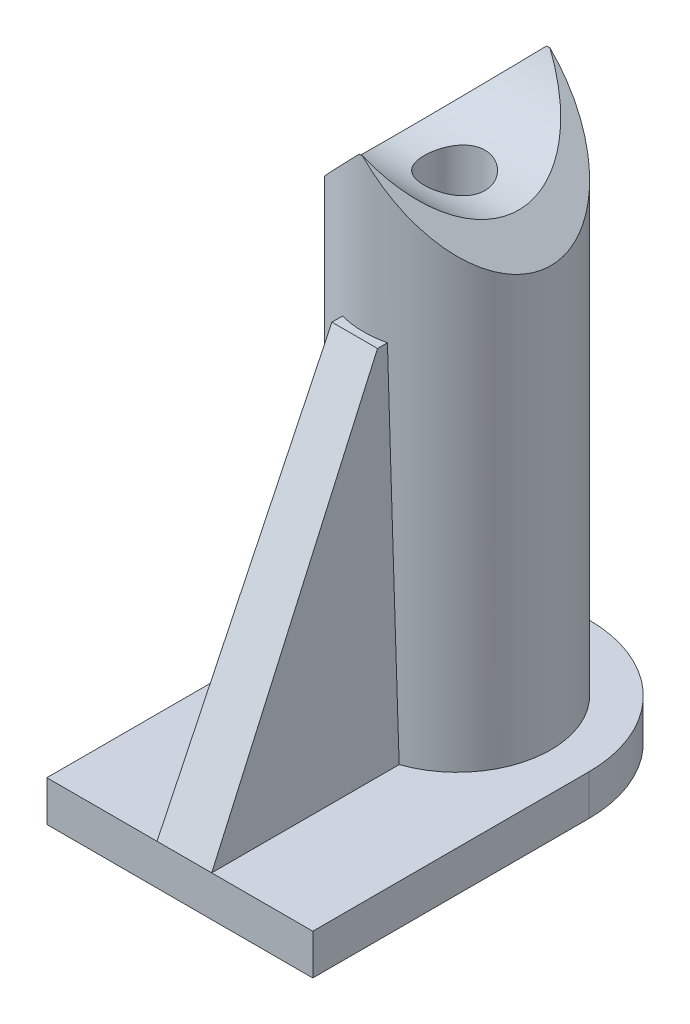
ISO-10303-21;
HEADER;
FILE_DESCRIPTION(('STEP AP214'),'2;1');
FILE_NAME('part.step','',(''),(''),'','','');
FILE_SCHEMA(('AUTOMOTIVE_DESIGN { 1 0 10303 214 1 1 1 1 }'));
ENDSEC;
DATA;
#1=APPLICATION_CONTEXT('core data for automotive mechanical design processes');
#2=APPLICATION_PROTOCOL_DEFINITION('international standard','automotive_design',2000,#1);
#3=PRODUCT_CONTEXT('',#1,'mechanical');
#4=PRODUCT('Part','Part','',(#3));
#5=PRODUCT_RELATED_PRODUCT_CATEGORY('part','',(#4));
#6=PRODUCT_DEFINITION_FORMATION('','',#4);
#7=PRODUCT_DEFINITION_CONTEXT('part definition',#1,'design');
#8=PRODUCT_DEFINITION('design','',#6,#7);
#9=PRODUCT_DEFINITION_SHAPE('','',#8);
#10=(LENGTH_UNIT() NAMED_UNIT(*) SI_UNIT(.MILLI.,.METRE.));
#11=(NAMED_UNIT(*) PLANE_ANGLE_UNIT() SI_UNIT($,.RADIAN.));
#12=(NAMED_UNIT(*) SI_UNIT($,.STERADIAN.) SOLID_ANGLE_UNIT());
#13=UNCERTAINTY_MEASURE_WITH_UNIT(LENGTH_MEASURE(1.E-05),#10,'distance_accuracy_value','');
#14=(GEOMETRIC_REPRESENTATION_CONTEXT(3) GLOBAL_UNCERTAINTY_ASSIGNED_CONTEXT((#13)) GLOBAL_UNIT_ASSIGNED_CONTEXT((#10,
#11,#12)) REPRESENTATION_CONTEXT('',''));
#15=CARTESIAN_POINT('',(0.,0.,0.));
#16=DIRECTION('',(0.,0.,1.));
#17=DIRECTION('',(1.,0.,0.));
#18=AXIS2_PLACEMENT_3D('',#15,#16,#17);
#19=CARTESIAN_POINT('',(-5.2,21.9,5.2));
#20=DIRECTION('',(0.,-1.,0.));
#21=DIRECTION('',(0.,0.,-1.));
#22=AXIS2_PLACEMENT_3D('',#19,#20,#21);
#23=CYLINDRICAL_SURFACE('',#22,3.7);
#24=CARTESIAN_POINT('',(-5.2,15.9,5.2));
#25=DIRECTION('',(0.,-1.,0.));
#26=DIRECTION('',(0.,0.,1.));
#27=AXIS2_PLACEMENT_3D('',#24,#25,#26);
#28=CIRCLE('',#27,3.7);
#29=CARTESIAN_POINT('',(-6.15,15.9,8.77596140918774));
#30=VERTEX_POINT('',#29);
#31=CARTESIAN_POINT('',(-4.34999999997192,15.9,8.80104151599954));
#32=VERTEX_POINT('',#31);
#33=EDGE_CURVE('E142',#30,#32,#28,.F.);
#34=ORIENTED_EDGE('',*,*,#33,.T.);
#35=CARTESIAN_POINT('',(-5.2,49.7751500020347,5.2));
#36=DIRECTION('',(-0.999685340837746,-0.0250842443402034,0.));
#37=DIRECTION('',(0.0250842443402034,-0.999685340837746,0.));
#38=AXIS2_PLACEMENT_3D('',#35,#36,#37);
#39=ELLIPSE('',#38,147.502948457167,3.7);
#40=CARTESIAN_POINT('',(-3.99118240068989,1.6,8.69696439953256));
#41=VERTEX_POINT('',#40);
#42=EDGE_CURVE('E176',#32,#41,#39,.F.);
#43=ORIENTED_EDGE('',*,*,#42,.T.);
#44=CARTESIAN_POINT('',(-5.2,1.6,5.2));
#45=DIRECTION('',(0.,-1.,0.));
#46=DIRECTION('',(0.,0.,1.));
#47=AXIS2_PLACEMENT_3D('',#44,#45,#46);
#48=CIRCLE('',#47,3.7);
#49=CARTESIAN_POINT('',(-6.15,1.6,8.77596140918774));
#50=VERTEX_POINT('',#49);
#51=EDGE_CURVE('E166',#50,#41,#48,.T.);
#52=ORIENTED_EDGE('',*,*,#51,.F.);
#53=DIRECTION('',(0.,-1.,0.));
#54=VECTOR('',#53,1.);
#55=CARTESIAN_POINT('',(-6.15,21.9,8.77596140918774));
#56=LINE('',#55,#54);
#57=EDGE_CURVE('E172',#50,#30,#56,.F.);
#58=ORIENTED_EDGE('',*,*,#57,.T.);
#59=EDGE_LOOP('',(#34,#43,#52,#58));
#60=FACE_BOUND('',#59,.T.);
#61=CARTESIAN_POINT('',(-5.2,21.8589822391826,5.2));
#62=DIRECTION('',(0.707106781186554,0.707106781186541,0.));
#63=DIRECTION('',(0.707106781186541,-0.707106781186554,0.));
#64=AXIS2_PLACEMENT_3D('',#61,#62,#63);
#65=ELLIPSE('',#64,5.2325901807805,3.7);
#66=CARTESIAN_POINT('',(-5.24048307471345,21.8994653138961,8.89977852319053));
#67=VERTEX_POINT('',#66);
#68=CARTESIAN_POINT('',(-5.24048307471566,21.8994653138983,1.50022147680951));
#69=VERTEX_POINT('',#68);
#70=EDGE_CURVE('E303',#67,#69,#65,.T.);
#71=ORIENTED_EDGE('',*,*,#70,.F.);
#72=CARTESIAN_POINT('',(-5.2,21.9,1.5));
#73=CARTESIAN_POINT('',(-5.30220118854143,21.8999861552881,1.50000329053625));
#74=CARTESIAN_POINT('',(-5.40441808191666,21.8894947726479,1.50429955744503));
#75=CARTESIAN_POINT('',(-5.60491412544944,21.8505158880821,1.52082991556372));
#76=CARTESIAN_POINT('',(-5.70317145254614,21.8219401894823,1.53310291703705));
#77=CARTESIAN_POINT('',(-5.87121813598477,21.7608106945932,1.56064452022894));
#78=CARTESIAN_POINT('',(-5.9422303586275,21.7308096358502,1.57451135835405));
#79=CARTESIAN_POINT('',(-6.08114170375435,21.6657767440427,1.60574743157836));
#80=CARTESIAN_POINT('',(-6.14903848089882,21.6307412003586,1.62311925384308));
#81=CARTESIAN_POINT('',(-6.3488882967008,21.5203913532359,1.68014901349179));
#82=CARTESIAN_POINT('',(-6.4766289158008,21.4399884665495,1.72465651225778));
#83=CARTESIAN_POINT('',(-6.71490698259938,21.2792030770967,1.82206581039771));
#84=CARTESIAN_POINT('',(-6.82602362636766,21.1991854825654,1.8741982756588));
#85=CARTESIAN_POINT('',(-7.04178237073929,21.0375117296007,1.988652379036));
#86=CARTESIAN_POINT('',(-7.14641969850108,20.9558544205898,2.05098140797828));
#87=CARTESIAN_POINT('',(-7.34933835839138,20.7933716974848,2.18584035487792));
#88=CARTESIAN_POINT('',(-7.44762715750579,20.7125454036964,2.25835795817353));
#89=CARTESIAN_POINT('',(-7.63769373918767,20.5534781770391,2.41383547186427));
#90=CARTESIAN_POINT('',(-7.72947509825423,20.4752358368578,2.4967895756838));
#91=CARTESIAN_POINT('',(-7.94897003387618,20.2858132103856,2.71652359058631));
#92=CARTESIAN_POINT('',(-8.07243404960116,20.17713330954,2.85985218041348));
#93=CARTESIAN_POINT('',(-8.29972739769978,19.9748992604763,3.17056111703932));
#94=CARTESIAN_POINT('',(-8.40359109775338,19.8813186793218,3.33789844179852));
#95=CARTESIAN_POINT('',(-8.56769351525543,19.7325174236787,3.65917248392195));
#96=CARTESIAN_POINT('',(-8.63250893189407,19.6733658437209,3.80889636296508));
#97=CARTESIAN_POINT('',(-8.71531935387495,19.5975488037141,4.04267961874061));
#98=CARTESIAN_POINT('',(-8.74052581938986,19.5744234473959,4.12216415322763));
#99=CARTESIAN_POINT('',(-8.78574586885089,19.5328819696268,4.28378172649424));
#100=CARTESIAN_POINT('',(-8.80576173225587,19.5144637810694,4.36591358482189));
#101=CARTESIAN_POINT('',(-8.84037438059293,19.4825850155868,4.53291625862229));
#102=CARTESIAN_POINT('',(-8.85493005397909,19.4691620551388,4.6178028219736));
#103=CARTESIAN_POINT('',(-8.8781188954863,19.4477664657864,4.78902392698739));
#104=CARTESIAN_POINT('',(-8.88675481697309,19.4397913030353,4.87535777632688));
#105=CARTESIAN_POINT('',(-8.89792707773942,19.4294723859938,5.04875009447969));
#106=CARTESIAN_POINT('',(-8.90046426153741,19.4271278520061,5.13580846129038));
#107=CARTESIAN_POINT('',(-8.89939502498305,19.4281155077124,5.3098263625634));
#108=CARTESIAN_POINT('',(-8.89578913137733,19.4314472106896,5.39678590485979));
#109=CARTESIAN_POINT('',(-8.87729749793132,19.4485254769984,5.63732403115231));
#110=CARTESIAN_POINT('',(-8.85581456543738,19.4683619230852,5.79004772530705));
#111=CARTESIAN_POINT('',(-8.79494752668963,19.5244260631929,6.0886169113682));
#112=CARTESIAN_POINT('',(-8.75556053690702,19.5606563975187,6.23446129115233));
#113=CARTESIAN_POINT('',(-8.65915777708952,19.6490013357018,6.52218096357648));
#114=CARTESIAN_POINT('',(-8.60149315320657,19.7016993707302,6.66365684117055));
#115=CARTESIAN_POINT('',(-8.47185455136396,19.8195068617113,6.93422221612513));
#116=CARTESIAN_POINT('',(-8.39987406841147,19.8846219593055,7.06330604297315));
#117=CARTESIAN_POINT('',(-8.20303543467088,20.0613385184196,7.3727465047799));
#118=CARTESIAN_POINT('',(-8.07025366533381,20.1794003471286,7.5444517801073));
#119=CARTESIAN_POINT('',(-7.8552833242326,20.3668029792136,7.77891327632925));
#120=CARTESIAN_POINT('',(-7.78083598440948,20.4311217894035,7.85333779192149));
#121=CARTESIAN_POINT('',(-7.62710408869393,20.5622521462416,7.99464681061368));
#122=CARTESIAN_POINT('',(-7.54782037954333,20.6290632557519,8.06153262776773));
#123=CARTESIAN_POINT('',(-7.38270755339974,20.7658470685964,8.18947787001646));
#124=CARTESIAN_POINT('',(-7.29676403040008,20.8358570312878,8.25034867814242));
#125=CARTESIAN_POINT('',(-7.12021819440276,20.9762227226005,8.36446055571283));
#126=CARTESIAN_POINT('',(-7.02961589020273,21.0465784505687,8.41770163956452));
#127=CARTESIAN_POINT('',(-6.84371911662066,21.1859742738523,8.51651169910498));
#128=CARTESIAN_POINT('',(-6.7484354647991,21.2550169341498,8.56209737795193));
#129=CARTESIAN_POINT('',(-6.55240484099297,21.3897878350268,8.64562805067155));
#130=CARTESIAN_POINT('',(-6.4516626553041,21.4555188848057,8.68357960515771));
#131=CARTESIAN_POINT('',(-6.25803884625461,21.5715853266806,8.74674847699734));
#132=CARTESIAN_POINT('',(-6.16602551800486,21.6227886319086,8.77300413514137));
#133=CARTESIAN_POINT('',(-5.97609902991764,21.7166474417492,8.81900546456139));
#134=CARTESIAN_POINT('',(-5.87819132229475,21.759310692452,8.83875704582132));
#135=CARTESIAN_POINT('',(-5.69398275994262,21.824211571132,8.86783907755175));
#136=CARTESIAN_POINT('',(-5.60871212833711,21.8487318921207,8.8783978229424));
#137=CARTESIAN_POINT('',(-5.43499064708258,21.8843944220393,8.89355218953716));
#138=CARTESIAN_POINT('',(-5.34654977895478,21.8955753716575,8.89816508205651));
#139=CARTESIAN_POINT('',(-5.1684178303178,21.9022688925758,8.90094179408382));
#140=CARTESIAN_POINT('',(-5.0787224795727,21.8976906186907,8.89906822153492));
#141=CARTESIAN_POINT('',(-4.90163506783468,21.8737114802237,8.88902357604518));
#142=CARTESIAN_POINT('',(-4.81424891151067,21.8542758263313,8.88083772218301));
#143=CARTESIAN_POINT('',(-4.60424539800062,21.7926146959105,8.85389120673591));
#144=CARTESIAN_POINT('',(-4.48398705089301,21.7440104710673,8.83199328062005));
#145=CARTESIAN_POINT('',(-4.25200081237684,21.633367465955,8.77848967156498));
#146=CARTESIAN_POINT('',(-4.1403135975003,21.5712694115346,8.74684089138749));
#147=CARTESIAN_POINT('',(-3.92158780233785,21.4386589659623,8.67407787442097));
#148=CARTESIAN_POINT('',(-3.81471718222212,21.3679847873628,8.63276107585714));
#149=CARTESIAN_POINT('',(-3.60705469743022,21.223251063502,8.54146635361594));
#150=CARTESIAN_POINT('',(-3.50626843930291,21.1491885031527,8.49148060116859));
#151=CARTESIAN_POINT('',(-3.31016484905568,21.0001428963845,8.38293440136031));
#152=CARTESIAN_POINT('',(-3.21484707794647,20.9251599244411,8.32437464363216));
#153=CARTESIAN_POINT('',(-3.02945771872571,20.7759509852149,8.19854928097493));
#154=CARTESIAN_POINT('',(-2.93938733571104,20.7017251950273,8.13128168757391));
#155=CARTESIAN_POINT('',(-2.77391470184935,20.5631483153687,7.99541075793236));
#156=CARTESIAN_POINT('',(-2.69796703209827,20.498581013182,7.92769548082345));
#157=CARTESIAN_POINT('',(-2.55080753368635,20.3721089310101,7.78501348280166));
#158=CARTESIAN_POINT('',(-2.47959710877104,20.3102049421235,7.71004462851065));
#159=CARTESIAN_POINT('',(-2.27414484646608,20.1301473592317,7.47435968492877));
#160=CARTESIAN_POINT('',(-2.14759265128003,20.0172317576592,7.30247020197285));
#161=CARTESIAN_POINT('',(-1.95006835475449,19.8394328351368,6.97612761517814));
#162=CARTESIAN_POINT('',(-1.87310739690448,19.7695950018666,6.8280285474842));
#163=CARTESIAN_POINT('',(-1.77191614604515,19.6773654333157,6.59479098951195));
#164=CARTESIAN_POINT('',(-1.74055307160102,19.6487030021413,6.51516994994541));
#165=CARTESIAN_POINT('',(-1.68304572006378,19.5960517222737,6.35258736956468));
#166=CARTESIAN_POINT('',(-1.65689908409703,19.5720607612598,6.26962735912183));
#167=CARTESIAN_POINT('',(-1.61005302250855,19.5290191966639,6.10004987450945));
#168=CARTESIAN_POINT('',(-1.58940608299807,19.5100162190577,6.01340571641963));
#169=CARTESIAN_POINT('',(-1.55430073790507,19.477676756696,5.83787279007397));
#170=CARTESIAN_POINT('',(-1.53983915151879,19.4643373594831,5.7489852004641));
#171=CARTESIAN_POINT('',(-1.51741320435203,19.4436416114366,5.56974057516832));
#172=CARTESIAN_POINT('',(-1.50944598374084,19.4362826270987,5.47938420416652));
#173=CARTESIAN_POINT('',(-1.50018550159053,19.4277284614055,5.2980455479931));
#174=CARTESIAN_POINT('',(-1.49889136310207,19.4265324701348,5.20706334663922));
#175=CARTESIAN_POINT('',(-1.50273133795836,19.4300800848953,5.03750184025578));
#176=CARTESIAN_POINT('',(-1.50703154373526,19.4340531783333,4.95888591500431));
#177=CARTESIAN_POINT('',(-1.52058113616982,19.4465646949622,4.80243951206051));
#178=CARTESIAN_POINT('',(-1.52983212305178,19.4551045942658,4.72460929662258));
#179=CARTESIAN_POINT('',(-1.56479954429822,19.4873583402911,4.4931912479431));
#180=CARTESIAN_POINT('',(-1.59773431492487,19.5177098625377,4.34152290040802));
#181=CARTESIAN_POINT('',(-1.68085260857059,19.5940587072025,4.04714024146694));
#182=CARTESIAN_POINT('',(-1.73105379554968,19.6400720515401,3.90443527731985));
#183=CARTESIAN_POINT('',(-1.84617469648876,19.7450843648457,3.63029179150034));
#184=CARTESIAN_POINT('',(-1.91109842686952,19.8040868772282,3.49885635775012));
#185=CARTESIAN_POINT('',(-2.08763353221639,19.9634822492083,3.18784480500316));
#186=CARTESIAN_POINT('',(-2.20666130525578,20.0701139465709,3.01561878353005));
#187=CARTESIAN_POINT('',(-2.40073927814134,20.2412345821472,2.77829174664166));
#188=CARTESIAN_POINT('',(-2.46817827853062,20.3002718261999,2.7025488874264));
#189=CARTESIAN_POINT('',(-2.60773559369747,20.4212238697834,2.55798548731715));
#190=CARTESIAN_POINT('',(-2.67985264960703,20.483137893909,2.4891630967287));
#191=CARTESIAN_POINT('',(-2.84711905796357,20.6248893632137,2.34179502736361));
#192=CARTESIAN_POINT('',(-2.94348391482636,20.7053028363687,2.26518625776051));
#193=CARTESIAN_POINT('',(-3.14256875860694,20.8676092341126,2.12233850521157));
#194=CARTESIAN_POINT('',(-3.24529297337529,20.9495031167383,2.05610652656885));
#195=CARTESIAN_POINT('',(-3.45696348842228,21.1124812684457,1.93400324514867));
#196=CARTESIAN_POINT('',(-3.56589791858349,21.1935667556203,1.87811299002446));
#197=CARTESIAN_POINT('',(-3.79085081751589,21.3521007693557,1.77662039437046));
#198=CARTESIAN_POINT('',(-3.90686071313561,21.4295535038604,1.73100590574176));
#199=CARTESIAN_POINT('',(-4.1246629455183,21.5619174797247,1.65822286333507));
#200=CARTESIAN_POINT('',(-4.2249209188819,21.6183044183054,1.62919461275267));
#201=CARTESIAN_POINT('',(-4.43242739644737,21.7208711168502,1.57892349221635));
#202=CARTESIAN_POINT('',(-4.53966258091512,21.7670696270273,1.55766627264631));
#203=CARTESIAN_POINT('',(-4.73869205280249,21.8341938119413,1.52779556067708));
#204=CARTESIAN_POINT('',(-4.82908163688891,21.8583726846856,1.51747486604692));
#205=CARTESIAN_POINT('',(-5.01298508059262,21.8912532891681,1.50358816134696));
#206=CARTESIAN_POINT('',(-5.10648596606411,21.9000126679041,1.49999698916105));
#207=CARTESIAN_POINT('',(-5.2,21.9,1.5));
#208=B_SPLINE_CURVE_WITH_KNOTS('',3,(#72,#73,#74,#75,#76,#77,#78,#79,#80,#81,#82,#83,#84,#85,
#86,#87,#88,#89,#90,#91,#92,#93,#94,#95,#96,#97,#98,#99,#100,#101,#102,#103,#104,#105,#106,#107,
#108,#109,#110,#111,#112,#113,#114,#115,#116,#117,#118,#119,#120,#121,#122,#123,#124,#125,#126,
#127,#128,#129,#130,#131,#132,#133,#134,#135,#136,#137,#138,#139,#140,#141,#142,#143,#144,#145,
#146,#147,#148,#149,#150,#151,#152,#153,#154,#155,#156,#157,#158,#159,#160,#161,#162,#163,#164,
#165,#166,#167,#168,#169,#170,#171,#172,#173,#174,#175,#176,#177,#178,#179,#180,#181,#182,#183,
#184,#185,#186,#187,#188,#189,#190,#191,#192,#193,#194,#195,#196,#197,#198,#199,#200,#201,#202,
#203,#204,#205,#206,#207),.UNSPECIFIED.,.T.,.F.,(4,2,2,2,2,2,2,2,2,2,2,2,2,2,2,2,2,2,2,2,2,2,2,
2,2,2,2,2,2,2,2,2,2,2,2,2,2,2,2,2,2,2,2,2,2,2,2,2,2,2,2,2,2,2,2,2,2,2,2,2,2,2,2,2,2,2,2,4),(0.,
0.306146909046892,0.613798516304356,0.848451404357704,1.08327813673251,1.55414308601822,
1.9932268897018,2.43263037842291,2.87150726894867,3.31014105167947,3.96223233682261,
4.61316938333827,5.13152126219224,5.39084450968198,5.65005368147635,5.91117711399101,
6.17217901150641,6.43314476488294,6.69408814251727,7.15823252357075,7.62245168365977,
8.1054554126339,8.58867911749745,9.32554281108332,9.69539213393251,10.065176889124,
10.4442527338627,10.8233278627804,11.2015648363416,11.579475358725,11.9045857812986,
12.2293999691114,12.496479259933,12.762780986333,13.0306203929502,13.299088887505,
13.6914940503146,14.0856590855335,14.4889686421615,14.8926443349392,15.2962875766972,
15.7000231552703,16.0612053843314,16.4224941669151,17.1428322337963,17.6834011663558,
17.953857332953,18.2241909206684,18.4970188144603,18.7697062379472,19.0422735170162,
19.3148049754884,19.5510072288074,19.7872858751379,20.2593895560146,20.7319776540032,
21.2046948330189,21.9053717739188,22.257180507078,22.608894957883,23.0494760386993,
23.4903532409564,23.9304143071714,24.3699523669107,24.7252798850365,25.0799479178643,
25.3611256348037,25.6412498960825),.UNSPECIFIED.);
#209=CARTESIAN_POINT('',(-5.36614753596505,21.8910185891588,8.89626771166439));
#210=VERTEX_POINT('',#209);
#211=EDGE_CURVE('E239',#210,#67,#208,.T.);
#212=ORIENTED_EDGE('',*,*,#211,.F.);
#213=CARTESIAN_POINT('',(-5.2,22.0617277897651,5.2));
#214=DIRECTION('',(-0.716616613550526,0.697467296138949,0.));
#215=DIRECTION('',(-0.697467296138949,-0.716616613550526,0.));
#216=AXIS2_PLACEMENT_3D('',#213,#214,#215);
#217=ELLIPSE('',#216,5.30490823079809,3.7);
#218=CARTESIAN_POINT('',(-7.79060151478678,19.4,7.84173878186024));
#219=VERTEX_POINT('',#218);
#220=EDGE_CURVE('E300',#219,#210,#217,.T.);
#221=ORIENTED_EDGE('',*,*,#220,.F.);
#222=DIRECTION('',(0.,-1.,0.));
#223=VECTOR('',#222,1.);
#224=CARTESIAN_POINT('',(-7.79060151478678,22.2116350067327,7.84173878186024));
#225=LINE('',#224,#223);
#226=CARTESIAN_POINT('',(-7.79060151478678,16.4,7.84173878186024));
#227=VERTEX_POINT('',#226);
#228=EDGE_CURVE('E310',#219,#227,#225,.T.);
#229=ORIENTED_EDGE('',*,*,#228,.T.);
#230=CARTESIAN_POINT('',(-5.2,16.4,5.2));
#231=DIRECTION('',(0.,-1.,0.));
#232=DIRECTION('',(0.,0.,1.));
#233=AXIS2_PLACEMENT_3D('',#230,#231,#232);
#234=CIRCLE('',#233,3.7);
#235=CARTESIAN_POINT('',(-7.79060151478678,16.4,2.55826121813976));
#236=VERTEX_POINT('',#235);
#237=EDGE_CURVE('E306',#227,#236,#234,.T.);
#238=ORIENTED_EDGE('',*,*,#237,.T.);
#239=DIRECTION('',(0.,-1.,0.));
#240=VECTOR('',#239,1.);
#241=CARTESIAN_POINT('',(-7.79060151478678,22.2116350067327,2.55826121813976));
#242=LINE('',#241,#240);
#243=CARTESIAN_POINT('',(-7.79060151478678,19.4,2.55826121813976));
#244=VERTEX_POINT('',#243);
#245=EDGE_CURVE('E240',#244,#236,#242,.T.);
#246=ORIENTED_EDGE('',*,*,#245,.F.);
#247=CARTESIAN_POINT('',(-5.36614753596487,21.8910185891588,1.5037322883356));
#248=VERTEX_POINT('',#247);
#249=EDGE_CURVE('E297',#248,#244,#217,.T.);
#250=ORIENTED_EDGE('',*,*,#249,.F.);
#251=EDGE_CURVE('E233',#69,#248,#208,.T.);
#252=ORIENTED_EDGE('',*,*,#251,.F.);
#253=EDGE_LOOP('',(#71,#212,#221,#229,#238,#246,#250,#252));
#254=FACE_BOUND('',#253,.T.);
#255=ADVANCED_FACE('F33',(#60,#254),#23,.T.);
#256=CARTESIAN_POINT('',(9.8,23.4322947838148,5.2));
#257=DIRECTION('',(-1.,0.,0.));
#258=DIRECTION('',(0.,0.,-1.));
#259=AXIS2_PLACEMENT_3D('',#256,#257,#258);
#260=CYLINDRICAL_SURFACE('',#259,4.00473810685618);
#261=CARTESIAN_POINT('',(-5.3,19.6115713831345,4.));
#262=CARTESIAN_POINT('',(-5.23424040619088,19.6115706960729,4.00000082883482));
#263=CARTESIAN_POINT('',(-5.16847261018046,19.6098550943304,4.00542378782113));
#264=CARTESIAN_POINT('',(-5.03885953647324,19.6032053936528,4.02691661695094));
#265=CARTESIAN_POINT('',(-4.97501491216385,19.5982702135022,4.04299006382453));
#266=CARTESIAN_POINT('',(-4.85114332255254,19.5857894048023,4.08518931591675));
#267=CARTESIAN_POINT('',(-4.79111021067222,19.5782481124115,4.11129843142027));
#268=CARTESIAN_POINT('',(-4.6762616171418,19.561410659837,4.17277306690415));
#269=CARTESIAN_POINT('',(-4.62144691422616,19.5521142383538,4.20813996546455));
#270=CARTESIAN_POINT('',(-4.51686045622883,19.5324848252323,4.28832172644045));
#271=CARTESIAN_POINT('',(-4.4672778007565,19.5221297896242,4.33337790374892));
#272=CARTESIAN_POINT('',(-4.37624700078883,19.5017382334039,4.43114208188345));
#273=CARTESIAN_POINT('',(-4.33479989947944,19.4917017537769,4.48385106248896));
#274=CARTESIAN_POINT('',(-4.26039595405093,19.4728278014941,4.59676947464099));
#275=CARTESIAN_POINT('',(-4.22763186404594,19.4640193295765,4.65711118700928));
#276=CARTESIAN_POINT('',(-4.17278946567554,19.4488499494873,4.78275669998628));
#277=CARTESIAN_POINT('',(-4.15070885844682,19.4424885148246,4.848059429585));
#278=CARTESIAN_POINT('',(-4.11848585327858,19.4330859464286,4.97979498948568));
#279=CARTESIAN_POINT('',(-4.10802069175961,19.4299552239126,5.04614236081902));
#280=CARTESIAN_POINT('',(-4.09830511879445,19.4270513535784,5.17972011986294));
#281=CARTESIAN_POINT('',(-4.09905235721133,19.4272775021546,5.24695031957971));
#282=CARTESIAN_POINT('',(-4.11152360640448,19.4309985414453,5.37812115858799));
#283=CARTESIAN_POINT('',(-4.12289809885467,19.4343893464164,5.44209844670505));
#284=CARTESIAN_POINT('',(-4.15573010512406,19.4439322421114,5.56719047061501));
#285=CARTESIAN_POINT('',(-4.17718825690359,19.4500845075429,5.62830502502299));
#286=CARTESIAN_POINT('',(-4.22981547850191,19.4646030602442,5.74676828879743));
#287=CARTESIAN_POINT('',(-4.26109458260207,19.4729942641522,5.80406493597114));
#288=CARTESIAN_POINT('',(-4.33238879304053,19.4911004972362,5.91270802745417));
#289=CARTESIAN_POINT('',(-4.37240596803636,19.5008158396847,5.96405305835951));
#290=CARTESIAN_POINT('',(-4.46185355458913,19.5209715357214,6.06142125112925));
#291=CARTESIAN_POINT('',(-4.5115868143578,19.5314254025533,6.10716377496546));
#292=CARTESIAN_POINT('',(-4.61812023657929,19.5515531123865,6.18973860628559));
#293=CARTESIAN_POINT('',(-4.67492109703341,19.5612268781886,6.22657003264382));
#294=CARTESIAN_POINT('',(-4.79471480587425,19.5787635398588,6.29056893074744));
#295=CARTESIAN_POINT('',(-4.85776158992098,19.5866082664635,6.31764078801835));
#296=CARTESIAN_POINT('',(-4.98780895324396,19.5993829242661,6.36069987942919));
#297=CARTESIAN_POINT('',(-5.05480823857378,19.6043138036218,6.3766907195941));
#298=CARTESIAN_POINT('',(-5.18818835302224,19.6104944423928,6.39660973509687));
#299=CARTESIAN_POINT('',(-5.25449951069602,19.6118742868647,6.40096441747525));
#300=CARTESIAN_POINT('',(-5.38690695740766,19.6111562942423,6.3986783694323));
#301=CARTESIAN_POINT('',(-5.45300327514756,19.6090589425822,6.39203917381173));
#302=CARTESIAN_POINT('',(-5.58132732902586,19.6017505251393,6.36833362264782));
#303=CARTESIAN_POINT('',(-5.64361092274324,19.5966215070327,6.35154176932997));
#304=CARTESIAN_POINT('',(-5.76447248578279,19.5839126198259,6.30832575010049));
#305=CARTESIAN_POINT('',(-5.82304988224111,19.5763323729425,6.28190009934861));
#306=CARTESIAN_POINT('',(-5.93657143691481,19.5593227023763,6.21935698932968));
#307=CARTESIAN_POINT('',(-5.99137623616537,19.5498491831854,6.18299887275123));
#308=CARTESIAN_POINT('',(-6.09426265454174,19.5302152139843,6.10190884046201));
#309=CARTESIAN_POINT('',(-6.14234266351001,19.5200546003197,6.05717492525856));
#310=CARTESIAN_POINT('',(-6.23227922774707,19.499728456033,5.95859829776346));
#311=CARTESIAN_POINT('',(-6.27383342885074,19.4895771344326,5.90447611670756));
#312=CARTESIAN_POINT('',(-6.34727716756395,19.4707985404727,5.78978504595997));
#313=CARTESIAN_POINT('',(-6.37916718597974,19.4621711923023,5.7292164771875));
#314=CARTESIAN_POINT('',(-6.4320696842099,19.4474653447567,5.60375286684333));
#315=CARTESIAN_POINT('',(-6.45316346106704,19.4413678631771,5.53889444221241));
#316=CARTESIAN_POINT('',(-6.48408312784867,19.4323249564029,5.40633797092195));
#317=CARTESIAN_POINT('',(-6.49391223332035,19.4293786317136,5.33864074033391));
#318=CARTESIAN_POINT('',(-6.50177947776745,19.4270246327306,5.20512287129608));
#319=CARTESIAN_POINT('',(-6.50025614689746,19.4274853435651,5.1393300708334));
#320=CARTESIAN_POINT('',(-6.48650975734242,19.4315835851709,5.00897861343441));
#321=CARTESIAN_POINT('',(-6.47428730286221,19.4352209365497,4.94441988701739));
#322=CARTESIAN_POINT('',(-6.43976076134664,19.4452263745653,4.81904102628078));
#323=CARTESIAN_POINT('',(-6.41756585284446,19.4515648514961,4.75818830184563));
#324=CARTESIAN_POINT('',(-6.36382208199501,19.4663170619105,4.64103865777939));
#325=CARTESIAN_POINT('',(-6.332271684541,19.474731135933,4.58474248774734));
#326=CARTESIAN_POINT('',(-6.25954400033369,19.4930845408269,4.47634956431047));
#327=CARTESIAN_POINT('',(-6.2180914032056,19.5030640064996,4.42444438601523));
#328=CARTESIAN_POINT('',(-6.12723209825788,19.5232946800755,4.32818016310275));
#329=CARTESIAN_POINT('',(-6.07782310191564,19.5335459654521,4.28382329720166));
#330=CARTESIAN_POINT('',(-5.97069158844833,19.5535181648007,4.20259132165106));
#331=CARTESIAN_POINT('',(-5.91276567237377,19.5632142692353,4.16597767965583));
#332=CARTESIAN_POINT('',(-5.79130017969921,19.5805806096673,4.10305103977588));
#333=CARTESIAN_POINT('',(-5.7277633302984,19.5882518227108,4.07673307107963));
#334=CARTESIAN_POINT('',(-5.60398372684793,19.5999379777974,4.03752825238679));
#335=CARTESIAN_POINT('',(-5.54413163921375,19.6042593375595,4.02349387114836));
#336=CARTESIAN_POINT('',(-5.42285520983435,19.6100760795481,4.00473028504809));
#337=CARTESIAN_POINT('',(-5.3614311839028,19.6115720249725,3.99999922572051));
#338=CARTESIAN_POINT('',(-5.3,19.6115713831345,4.));
#339=B_SPLINE_CURVE_WITH_KNOTS('',3,(#261,#262,#263,#264,#265,#266,#267,#268,#269,#270,#271,
#272,#273,#274,#275,#276,#277,#278,#279,#280,#281,#282,#283,#284,#285,#286,#287,#288,#289,#290,
#291,#292,#293,#294,#295,#296,#297,#298,#299,#300,#301,#302,#303,#304,#305,#306,#307,#308,#309,
#310,#311,#312,#313,#314,#315,#316,#317,#318,#319,#320,#321,#322,#323,#324,#325,#326,#327,#328,
#329,#330,#331,#332,#333,#334,#335,#336,#337,#338),.UNSPECIFIED.,.T.,.F.,(4,2,2,2,2,2,2,2,2,2,2,
2,2,2,2,2,2,2,2,2,2,2,2,2,2,2,2,2,2,2,2,2,2,2,2,2,2,2,4),(0.,0.197052178311741,
0.394170565788285,0.590962546068643,0.787783847405182,0.990235081861163,1.19271225880543,
1.39936575285447,1.60597475957146,1.80668651756704,2.00735620664583,2.20165003620309,
2.39595615975442,2.59252203541954,2.78913449678985,2.99330890316097,3.197503489971,
3.40364743764491,3.60972426966042,3.80813685024686,4.00652173377248,4.19976872242487,
4.39304550849671,4.59149970229392,4.79000133214151,4.99597426229815,5.20193694333814,
5.40632499795418,5.61065469460841,5.80713349017025,6.00360119082494,6.19796847801459,
6.39236767586099,6.59297634414738,6.79364281750412,7.00027171804097,7.20680073344513,
7.39091930220644,7.5750011662072),.UNSPECIFIED.);
#340=CARTESIAN_POINT('',(-5.3,19.6115713831345,4.));
#341=VERTEX_POINT('',#340);
#342=EDGE_CURVE('E183',#341,#341,#339,.T.);
#343=ORIENTED_EDGE('',*,*,#342,.T.);
#344=EDGE_LOOP('',(#343));
#345=FACE_BOUND('',#344,.T.);
#346=ORIENTED_EDGE('',*,*,#251,.T.);
#347=CARTESIAN_POINT('',(-3.86605708346487,23.4322947838148,5.2));
#348=DIRECTION('',(-0.716616613550526,0.697467296138949,0.));
#349=DIRECTION('',(-0.697467296138949,-0.716616613550526,0.));
#350=AXIS2_PLACEMENT_3D('',#347,#348,#349);
#351=ELLIPSE('',#350,5.58839696307685,4.00473810685618);
#352=EDGE_CURVE('E296',#210,#248,#351,.F.);
#353=ORIENTED_EDGE('',*,*,#352,.F.);
#354=ORIENTED_EDGE('',*,*,#211,.T.);
#355=CARTESIAN_POINT('',(-6.77331254463211,23.4322947838148,5.2));
#356=DIRECTION('',(0.707106781186554,0.707106781186541,0.));
#357=DIRECTION('',(-0.707106781186541,0.707106781186554,0.));
#358=AXIS2_PLACEMENT_3D('',#355,#356,#357);
#359=ELLIPSE('',#358,5.66355494446831,4.00473810685618);
#360=EDGE_CURVE('E288',#69,#67,#359,.F.);
#361=ORIENTED_EDGE('',*,*,#360,.F.);
#362=EDGE_LOOP('',(#346,#353,#354,#361));
#363=FACE_BOUND('',#362,.T.);
#364=ADVANCED_FACE('F225',(#345,#363),#260,.F.);
#365=CARTESIAN_POINT('',(0.,1.6,0.));
#366=DIRECTION('',(0.,1.,0.));
#367=DIRECTION('',(0.,0.,1.));
#368=AXIS2_PLACEMENT_3D('',#365,#366,#367);
#369=PLANE('',#368);
#370=DIRECTION('',(0.,0.,1.));
#371=VECTOR('',#370,1.);
#372=CARTESIAN_POINT('',(-6.15,1.6,-500000.));
#373=LINE('',#372,#371);
#374=CARTESIAN_POINT('',(-6.15,1.6,16.1));
#375=VERTEX_POINT('',#374);
#376=EDGE_CURVE('E168',#50,#375,#373,.T.);
#377=ORIENTED_EDGE('',*,*,#376,.F.);
#378=ORIENTED_EDGE('',*,*,#51,.T.);
#379=DIRECTION('',(0.,0.,1.));
#380=VECTOR('',#379,1.);
#381=CARTESIAN_POINT('',(-3.99118240068989,1.6,-500000.));
#382=LINE('',#381,#380);
#383=CARTESIAN_POINT('',(-3.99118240068989,1.6,16.1));
#384=VERTEX_POINT('',#383);
#385=EDGE_CURVE('E139',#41,#384,#382,.T.);
#386=ORIENTED_EDGE('',*,*,#385,.T.);
#387=DIRECTION('',(-1.,0.,0.));
#388=VECTOR('',#387,1.);
#389=CARTESIAN_POINT('',(0.,1.6,16.1));
#390=LINE('',#389,#388);
#391=CARTESIAN_POINT('',(0.,1.6,16.1));
#392=VERTEX_POINT('',#391);
#393=EDGE_CURVE('E154',#392,#384,#390,.T.);
#394=ORIENTED_EDGE('',*,*,#393,.F.);
#395=DIRECTION('',(0.,0.,1.));
#396=VECTOR('',#395,1.);
#397=CARTESIAN_POINT('',(0.,1.6,0.));
#398=LINE('',#397,#396);
#399=CARTESIAN_POINT('',(0.,1.6,5.2));
#400=VERTEX_POINT('',#399);
#401=EDGE_CURVE('E244',#400,#392,#398,.T.);
#402=ORIENTED_EDGE('',*,*,#401,.F.);
#403=CARTESIAN_POINT('',(-5.2,1.6,5.2));
#404=DIRECTION('',(0.,-1.,0.));
#405=DIRECTION('',(0.,0.,1.));
#406=AXIS2_PLACEMENT_3D('',#403,#404,#405);
#407=CIRCLE('',#406,5.2);
#408=CARTESIAN_POINT('',(-5.2,1.6,0.));
#409=VERTEX_POINT('',#408);
#410=EDGE_CURVE('E281',#409,#400,#407,.T.);
#411=ORIENTED_EDGE('',*,*,#410,.F.);
#412=DIRECTION('',(1.,0.,0.));
#413=VECTOR('',#412,1.);
#414=CARTESIAN_POINT('',(0.,1.6,0.));
#415=LINE('',#414,#413);
#416=CARTESIAN_POINT('',(-5.3,1.6,0.));
#417=VERTEX_POINT('',#416);
#418=EDGE_CURVE('E249',#417,#409,#415,.T.);
#419=ORIENTED_EDGE('',*,*,#418,.F.);
#420=CARTESIAN_POINT('',(-5.3,1.6,5.2));
#421=DIRECTION('',(0.,-1.,0.));
#422=DIRECTION('',(0.,0.,1.));
#423=AXIS2_PLACEMENT_3D('',#420,#421,#422);
#424=CIRCLE('',#423,5.2);
#425=CARTESIAN_POINT('',(-10.5,1.6,5.2));
#426=VERTEX_POINT('',#425);
#427=EDGE_CURVE('E278',#426,#417,#424,.T.);
#428=ORIENTED_EDGE('',*,*,#427,.F.);
#429=DIRECTION('',(0.,0.,-1.));
#430=VECTOR('',#429,1.);
#431=CARTESIAN_POINT('',(-10.5,1.6,0.));
#432=LINE('',#431,#430);
#433=CARTESIAN_POINT('',(-10.5,1.6,16.1));
#434=VERTEX_POINT('',#433);
#435=EDGE_CURVE('E161',#434,#426,#432,.T.);
#436=ORIENTED_EDGE('',*,*,#435,.F.);
#437=EDGE_CURVE('E162',#375,#434,#390,.T.);
#438=ORIENTED_EDGE('',*,*,#437,.F.);
#439=EDGE_LOOP('',(#377,#378,#386,#394,#402,#411,#419,#428,#436,#438));
#440=FACE_BOUND('',#439,.T.);
#441=ADVANCED_FACE('F164',(#440),#369,.T.);
#442=CARTESIAN_POINT('',(0.,1.6,0.));
#443=DIRECTION('',(-1.,0.,0.));
#444=DIRECTION('',(0.,0.,-1.));
#445=AXIS2_PLACEMENT_3D('',#442,#443,#444);
#446=PLANE('',#445);
#447=ORIENTED_EDGE('',*,*,#401,.T.);
#448=DIRECTION('',(0.,-1.,0.));
#449=VECTOR('',#448,1.);
#450=CARTESIAN_POINT('',(0.,1.6,16.1));
#451=LINE('',#450,#449);
#452=CARTESIAN_POINT('',(0.,0.,16.1));
#453=VERTEX_POINT('',#452);
#454=EDGE_CURVE('E157',#392,#453,#451,.T.);
#455=ORIENTED_EDGE('',*,*,#454,.T.);
#456=DIRECTION('',(0.,0.,1.));
#457=VECTOR('',#456,1.);
#458=CARTESIAN_POINT('',(0.,0.,0.));
#459=LINE('',#458,#457);
#460=CARTESIAN_POINT('',(0.,0.,5.2));
#461=VERTEX_POINT('',#460);
#462=EDGE_CURVE('E243',#461,#453,#459,.T.);
#463=ORIENTED_EDGE('',*,*,#462,.F.);
#464=DIRECTION('',(0.,-1.,0.));
#465=VECTOR('',#464,1.);
#466=CARTESIAN_POINT('',(0.,1.6,5.2));
#467=LINE('',#466,#465);
#468=EDGE_CURVE('E266',#400,#461,#467,.T.);
#469=ORIENTED_EDGE('',*,*,#468,.F.);
#470=EDGE_LOOP('',(#447,#455,#463,#469));
#471=FACE_BOUND('',#470,.T.);
#472=ADVANCED_FACE('F341',(#471),#446,.F.);
#473=CARTESIAN_POINT('',(0.,1.6,16.1));
#474=DIRECTION('',(0.,0.,-1.));
#475=DIRECTION('',(1.,0.,0.));
#476=AXIS2_PLACEMENT_3D('',#473,#474,#475);
#477=PLANE('',#476);
#478=ORIENTED_EDGE('',*,*,#437,.T.);
#479=DIRECTION('',(0.,-1.,0.));
#480=VECTOR('',#479,1.);
#481=CARTESIAN_POINT('',(-10.5,1.6,16.1));
#482=LINE('',#481,#480);
#483=CARTESIAN_POINT('',(-10.5,0.,16.1));
#484=VERTEX_POINT('',#483);
#485=EDGE_CURVE('E252',#434,#484,#482,.T.);
#486=ORIENTED_EDGE('',*,*,#485,.T.);
#487=DIRECTION('',(-1.,0.,0.));
#488=VECTOR('',#487,1.);
#489=CARTESIAN_POINT('',(0.,0.,16.1));
#490=LINE('',#489,#488);
#491=EDGE_CURVE('E255',#453,#484,#490,.T.);
#492=ORIENTED_EDGE('',*,*,#491,.F.);
#493=ORIENTED_EDGE('',*,*,#454,.F.);
#494=ORIENTED_EDGE('',*,*,#393,.T.);
#495=DIRECTION('',(-1.,0.,0.));
#496=VECTOR('',#495,1.);
#497=CARTESIAN_POINT('',(0.00100000000000013,1.6,16.1));
#498=LINE('',#497,#496);
#499=EDGE_CURVE('E145',#384,#375,#498,.T.);
#500=ORIENTED_EDGE('',*,*,#499,.T.);
#501=EDGE_LOOP('',(#478,#486,#492,#493,#494,#500));
#502=FACE_BOUND('',#501,.T.);
#503=ADVANCED_FACE('F155',(#502),#477,.F.);
#504=CARTESIAN_POINT('',(-10.5,1.6,0.));
#505=DIRECTION('',(1.,0.,0.));
#506=DIRECTION('',(0.,0.,1.));
#507=AXIS2_PLACEMENT_3D('',#504,#505,#506);
#508=PLANE('',#507);
#509=DIRECTION('',(0.,0.,-1.));
#510=VECTOR('',#509,1.);
#511=CARTESIAN_POINT('',(-10.5,0.,0.));
#512=LINE('',#511,#510);
#513=CARTESIAN_POINT('',(-10.5,0.,5.2));
#514=VERTEX_POINT('',#513);
#515=EDGE_CURVE('E258',#484,#514,#512,.T.);
#516=ORIENTED_EDGE('',*,*,#515,.F.);
#517=ORIENTED_EDGE('',*,*,#485,.F.);
#518=ORIENTED_EDGE('',*,*,#435,.T.);
#519=DIRECTION('',(0.,-1.,0.));
#520=VECTOR('',#519,1.);
#521=CARTESIAN_POINT('',(-10.5,1.6,5.2));
#522=LINE('',#521,#520);
#523=EDGE_CURVE('E284',#514,#426,#522,.F.);
#524=ORIENTED_EDGE('',*,*,#523,.F.);
#525=EDGE_LOOP('',(#516,#517,#518,#524));
#526=FACE_BOUND('',#525,.T.);
#527=ADVANCED_FACE('F335',(#526),#508,.F.);
#528=CARTESIAN_POINT('',(0.,1.6,0.));
#529=DIRECTION('',(0.,0.,1.));
#530=DIRECTION('',(-1.,0.,0.));
#531=AXIS2_PLACEMENT_3D('',#528,#529,#530);
#532=PLANE('',#531);
#533=DIRECTION('',(1.,0.,0.));
#534=VECTOR('',#533,1.);
#535=CARTESIAN_POINT('',(0.,0.,0.));
#536=LINE('',#535,#534);
#537=CARTESIAN_POINT('',(-5.3,0.,0.));
#538=VERTEX_POINT('',#537);
#539=CARTESIAN_POINT('',(-5.2,0.,0.));
#540=VERTEX_POINT('',#539);
#541=EDGE_CURVE('E245',#538,#540,#536,.T.);
#542=ORIENTED_EDGE('',*,*,#541,.F.);
#543=DIRECTION('',(0.,-1.,0.));
#544=VECTOR('',#543,1.);
#545=CARTESIAN_POINT('',(-5.3,1.6,0.));
#546=LINE('',#545,#544);
#547=EDGE_CURVE('E273',#417,#538,#546,.T.);
#548=ORIENTED_EDGE('',*,*,#547,.F.);
#549=ORIENTED_EDGE('',*,*,#418,.T.);
#550=DIRECTION('',(0.,-1.,0.));
#551=VECTOR('',#550,1.);
#552=CARTESIAN_POINT('',(-5.2,1.6,0.));
#553=LINE('',#552,#551);
#554=EDGE_CURVE('E276',#540,#409,#553,.F.);
#555=ORIENTED_EDGE('',*,*,#554,.F.);
#556=EDGE_LOOP('',(#542,#548,#549,#555));
#557=FACE_BOUND('',#556,.T.);
#558=ADVANCED_FACE('F349',(#557),#532,.F.);
#559=CARTESIAN_POINT('',(0.,0.,0.));
#560=DIRECTION('',(0.,1.,0.));
#561=DIRECTION('',(0.,0.,1.));
#562=AXIS2_PLACEMENT_3D('',#559,#560,#561);
#563=PLANE('',#562);
#564=CARTESIAN_POINT('',(-5.3,0.,5.2));
#565=DIRECTION('',(0.,-1.,0.));
#566=DIRECTION('',(0.,0.,1.));
#567=AXIS2_PLACEMENT_3D('',#564,#565,#566);
#568=CIRCLE('',#567,3.275);
#569=CARTESIAN_POINT('',(-5.3,0.,8.475));
#570=VERTEX_POINT('',#569);
#571=EDGE_CURVE('E11',#570,#570,#568,.T.);
#572=ORIENTED_EDGE('',*,*,#571,.F.);
#573=EDGE_LOOP('',(#572));
#574=FACE_BOUND('',#573,.T.);
#575=ORIENTED_EDGE('',*,*,#462,.T.);
#576=ORIENTED_EDGE('',*,*,#491,.T.);
#577=ORIENTED_EDGE('',*,*,#515,.T.);
#578=CARTESIAN_POINT('',(-5.3,0.,5.2));
#579=DIRECTION('',(0.,-1.,0.));
#580=DIRECTION('',(0.,0.,1.));
#581=AXIS2_PLACEMENT_3D('',#578,#579,#580);
#582=CIRCLE('',#581,5.2);
#583=EDGE_CURVE('E269',#538,#514,#582,.F.);
#584=ORIENTED_EDGE('',*,*,#583,.F.);
#585=ORIENTED_EDGE('',*,*,#541,.T.);
#586=CARTESIAN_POINT('',(-5.2,0.,5.2));
#587=DIRECTION('',(0.,-1.,0.));
#588=DIRECTION('',(0.,0.,1.));
#589=AXIS2_PLACEMENT_3D('',#586,#587,#588);
#590=CIRCLE('',#589,5.2);
#591=EDGE_CURVE('E271',#461,#540,#590,.F.);
#592=ORIENTED_EDGE('',*,*,#591,.F.);
#593=EDGE_LOOP('',(#575,#576,#577,#584,#585,#592));
#594=FACE_BOUND('',#593,.T.);
#595=ADVANCED_FACE('F338',(#574,#594),#563,.F.);
#596=CARTESIAN_POINT('',(-5.2,1.6,5.2));
#597=DIRECTION('',(0.,-1.,0.));
#598=DIRECTION('',(0.,0.,-1.));
#599=AXIS2_PLACEMENT_3D('',#596,#597,#598);
#600=CYLINDRICAL_SURFACE('',#599,5.2);
#601=ORIENTED_EDGE('',*,*,#410,.T.);
#602=ORIENTED_EDGE('',*,*,#468,.T.);
#603=ORIENTED_EDGE('',*,*,#591,.T.);
#604=ORIENTED_EDGE('',*,*,#554,.T.);
#605=EDGE_LOOP('',(#601,#602,#603,#604));
#606=FACE_BOUND('',#605,.T.);
#607=ADVANCED_FACE('F345',(#606),#600,.T.);
#608=CARTESIAN_POINT('',(-5.3,1.6,5.2));
#609=DIRECTION('',(0.,-1.,0.));
#610=DIRECTION('',(0.,0.,-1.));
#611=AXIS2_PLACEMENT_3D('',#608,#609,#610);
#612=CYLINDRICAL_SURFACE('',#611,5.2);
#613=ORIENTED_EDGE('',*,*,#427,.T.);
#614=ORIENTED_EDGE('',*,*,#547,.T.);
#615=ORIENTED_EDGE('',*,*,#583,.T.);
#616=ORIENTED_EDGE('',*,*,#523,.T.);
#617=EDGE_LOOP('',(#613,#614,#615,#616));
#618=FACE_BOUND('',#617,.T.);
#619=ADVANCED_FACE('F223',(#618),#612,.T.);
#620=CARTESIAN_POINT('',(-7.79060151478678,22.2116350067327,2.55826121813976));
#621=DIRECTION('',(-1.,0.,0.));
#622=DIRECTION('',(0.,0.,-1.));
#623=AXIS2_PLACEMENT_3D('',#620,#621,#622);
#624=PLANE('',#623);
#625=DIRECTION('',(0.,0.,-1.));
#626=VECTOR('',#625,1.);
#627=CARTESIAN_POINT('',(-7.79060151478678,19.4,2.55826121813976));
#628=LINE('',#627,#626);
#629=EDGE_CURVE('E286',#219,#244,#628,.T.);
#630=ORIENTED_EDGE('',*,*,#629,.T.);
#631=ORIENTED_EDGE('',*,*,#245,.T.);
#632=DIRECTION('',(0.,0.,1.));
#633=VECTOR('',#632,1.);
#634=CARTESIAN_POINT('',(-7.79060151478678,16.4,2.55826121813976));
#635=LINE('',#634,#633);
#636=EDGE_CURVE('E309',#236,#227,#635,.T.);
#637=ORIENTED_EDGE('',*,*,#636,.T.);
#638=ORIENTED_EDGE('',*,*,#228,.F.);
#639=EDGE_LOOP('',(#630,#631,#637,#638));
#640=FACE_BOUND('',#639,.T.);
#641=ADVANCED_FACE('F219',(#640),#624,.T.);
#642=CARTESIAN_POINT('',(-5.2,16.4,5.2));
#643=DIRECTION('',(0.,1.,0.));
#644=DIRECTION('',(0.,0.,1.));
#645=AXIS2_PLACEMENT_3D('',#642,#643,#644);
#646=PLANE('',#645);
#647=ORIENTED_EDGE('',*,*,#237,.F.);
#648=ORIENTED_EDGE('',*,*,#636,.F.);
#649=EDGE_LOOP('',(#647,#648));
#650=FACE_BOUND('',#649,.T.);
#651=ADVANCED_FACE('F212',(#650),#646,.T.);
#652=CARTESIAN_POINT('',(-5.3,21.9589822391827,-4.2));
#653=DIRECTION('',(0.716616613550526,-0.697467296138949,0.));
#654=DIRECTION('',(-0.697467296138949,-0.716616613550526,0.));
#655=AXIS2_PLACEMENT_3D('',#652,#653,#654);
#656=PLANE('',#655);
#657=ORIENTED_EDGE('',*,*,#629,.F.);
#658=ORIENTED_EDGE('',*,*,#220,.T.);
#659=ORIENTED_EDGE('',*,*,#352,.T.);
#660=ORIENTED_EDGE('',*,*,#249,.T.);
#661=EDGE_LOOP('',(#657,#658,#659,#660));
#662=FACE_BOUND('',#661,.T.);
#663=ADVANCED_FACE('F209',(#662),#656,.F.);
#664=CARTESIAN_POINT('',(-5.3,21.9589822391827,-4.2));
#665=DIRECTION('',(-0.707106781186554,-0.707106781186541,0.));
#666=DIRECTION('',(-0.707106781186541,0.707106781186554,0.));
#667=AXIS2_PLACEMENT_3D('',#664,#665,#666);
#668=PLANE('',#667);
#669=ORIENTED_EDGE('',*,*,#70,.T.);
#670=ORIENTED_EDGE('',*,*,#360,.T.);
#671=EDGE_LOOP('',(#669,#670));
#672=FACE_BOUND('',#671,.T.);
#673=ADVANCED_FACE('F207',(#672),#668,.F.);
#674=CARTESIAN_POINT('',(-5.3,16.3,5.2));
#675=DIRECTION('',(0.,-1.,0.));
#676=DIRECTION('',(0.,0.,-1.));
#677=AXIS2_PLACEMENT_3D('',#674,#675,#676);
#678=CYLINDRICAL_SURFACE('',#677,2.275);
#679=CARTESIAN_POINT('',(-5.3,1.,5.2));
#680=DIRECTION('',(0.,-1.,0.));
#681=DIRECTION('',(0.,0.,1.));
#682=AXIS2_PLACEMENT_3D('',#679,#680,#681);
#683=CIRCLE('',#682,2.275);
#684=CARTESIAN_POINT('',(-5.3,1.,7.475));
#685=VERTEX_POINT('',#684);
#686=EDGE_CURVE('E41',#685,#685,#683,.F.);
#687=ORIENTED_EDGE('',*,*,#686,.F.);
#688=EDGE_LOOP('',(#687));
#689=FACE_BOUND('',#688,.T.);
#690=CARTESIAN_POINT('',(-5.3,16.3,5.2));
#691=DIRECTION('',(0.,1.,0.));
#692=DIRECTION('',(0.,0.,-1.));
#693=AXIS2_PLACEMENT_3D('',#690,#691,#692);
#694=CIRCLE('',#693,2.275);
#695=CARTESIAN_POINT('',(-5.3,16.3,2.925));
#696=VERTEX_POINT('',#695);
#697=EDGE_CURVE('E190',#696,#696,#694,.T.);
#698=ORIENTED_EDGE('',*,*,#697,.T.);
#699=EDGE_LOOP('',(#698));
#700=FACE_BOUND('',#699,.T.);
#701=ADVANCED_FACE('F203',(#689,#700),#678,.F.);
#702=CARTESIAN_POINT('',(-5.3,16.3,5.2));
#703=DIRECTION('',(0.,-1.,0.));
#704=DIRECTION('',(0.,0.,-1.));
#705=AXIS2_PLACEMENT_3D('',#702,#703,#704);
#706=PLANE('',#705);
#707=CARTESIAN_POINT('',(-5.3,16.3,5.2));
#708=DIRECTION('',(0.,1.,0.));
#709=DIRECTION('',(0.,0.,-1.));
#710=AXIS2_PLACEMENT_3D('',#707,#708,#709);
#711=CIRCLE('',#710,1.2);
#712=CARTESIAN_POINT('',(-5.3,16.3,4.));
#713=VERTEX_POINT('',#712);
#714=EDGE_CURVE('E180',#713,#713,#711,.T.);
#715=ORIENTED_EDGE('',*,*,#714,.T.);
#716=EDGE_LOOP('',(#715));
#717=FACE_BOUND('',#716,.T.);
#718=ORIENTED_EDGE('',*,*,#697,.F.);
#719=EDGE_LOOP('',(#718));
#720=FACE_BOUND('',#719,.T.);
#721=ADVANCED_FACE('F200',(#717,#720),#706,.T.);
#722=CARTESIAN_POINT('',(-5.3,1.,5.2));
#723=DIRECTION('',(0.,-1.,0.));
#724=DIRECTION('',(0.,0.,-1.));
#725=AXIS2_PLACEMENT_3D('',#722,#723,#724);
#726=CONICAL_SURFACE('',#725,2.275,0.78539816339745);
#727=ORIENTED_EDGE('',*,*,#571,.T.);
#728=EDGE_LOOP('',(#727));
#729=FACE_BOUND('',#728,.T.);
#730=ORIENTED_EDGE('',*,*,#686,.T.);
#731=EDGE_LOOP('',(#730));
#732=FACE_BOUND('',#731,.T.);
#733=ADVANCED_FACE('F35',(#729,#732),#726,.F.);
#734=CARTESIAN_POINT('',(-5.3,21.906017893391,5.2));
#735=DIRECTION('',(0.,-1.,0.));
#736=DIRECTION('',(0.,0.,-1.));
#737=AXIS2_PLACEMENT_3D('',#734,#735,#736);
#738=CYLINDRICAL_SURFACE('',#737,1.2);
#739=ORIENTED_EDGE('',*,*,#714,.F.);
#740=EDGE_LOOP('',(#739));
#741=FACE_BOUND('',#740,.T.);
#742=ORIENTED_EDGE('',*,*,#342,.F.);
#743=EDGE_LOOP('',(#742));
#744=FACE_BOUND('',#743,.T.);
#745=ADVANCED_FACE('F194',(#741,#744),#738,.F.);
#746=CARTESIAN_POINT('',(-6.15,1.6,-500000.));
#747=DIRECTION('',(-1.,0.,0.));
#748=DIRECTION('',(0.,0.,-1.));
#749=AXIS2_PLACEMENT_3D('',#746,#747,#748);
#750=PLANE('',#749);
#751=DIRECTION('',(0.,0.900476019142608,-0.4349056667245));
#752=VECTOR('',#751,1.);
#753=CARTESIAN_POINT('',(-6.15,6.60774489026023,13.6813940804792));
#754=LINE('',#753,#752);
#755=CARTESIAN_POINT('',(-6.15,15.9,9.19348511013141));
#756=VERTEX_POINT('',#755);
#757=EDGE_CURVE('E148',#375,#756,#754,.T.);
#758=ORIENTED_EDGE('',*,*,#757,.T.);
#759=DIRECTION('',(0.,0.,1.));
#760=VECTOR('',#759,1.);
#761=CARTESIAN_POINT('',(-6.15,15.9,-500000.));
#762=LINE('',#761,#760);
#763=EDGE_CURVE('E55',#30,#756,#762,.T.);
#764=ORIENTED_EDGE('',*,*,#763,.F.);
#765=ORIENTED_EDGE('',*,*,#57,.F.);
#766=ORIENTED_EDGE('',*,*,#376,.T.);
#767=EDGE_LOOP('',(#758,#764,#765,#766));
#768=FACE_BOUND('',#767,.T.);
#769=ADVANCED_FACE('F198',(#768),#750,.T.);
#770=CARTESIAN_POINT('',(-4.35,15.9,-500000.));
#771=DIRECTION('',(0.999685340837746,0.0250842443402034,0.));
#772=DIRECTION('',(0.0250842443402034,-0.999685340837746,0.));
#773=AXIS2_PLACEMENT_3D('',#770,#771,#772);
#774=PLANE('',#773);
#775=DIRECTION('',(-0.0225891047183369,0.90024624793569,-0.434794693419477));
#776=VECTOR('',#775,1.);
#777=CARTESIAN_POINT('',(-4.11473623637912,6.52400554976382,13.7218379267732));
#778=LINE('',#777,#776);
#779=CARTESIAN_POINT('',(-4.35,15.9,9.19348511015101));
#780=VERTEX_POINT('',#779);
#781=EDGE_CURVE('E134',#384,#780,#778,.T.);
#782=ORIENTED_EDGE('',*,*,#781,.F.);
#783=ORIENTED_EDGE('',*,*,#385,.F.);
#784=ORIENTED_EDGE('',*,*,#42,.F.);
#785=DIRECTION('',(0.,0.,1.));
#786=VECTOR('',#785,1.);
#787=CARTESIAN_POINT('',(-4.35,15.9,-500000.));
#788=LINE('',#787,#786);
#789=EDGE_CURVE('E141',#32,#780,#788,.T.);
#790=ORIENTED_EDGE('',*,*,#789,.T.);
#791=EDGE_LOOP('',(#782,#783,#784,#790));
#792=FACE_BOUND('',#791,.T.);
#793=ADVANCED_FACE('F136',(#792),#774,.T.);
#794=CARTESIAN_POINT('',(-6.15,15.9,-500000.));
#795=DIRECTION('',(0.,1.,0.));
#796=DIRECTION('',(0.,0.,1.));
#797=AXIS2_PLACEMENT_3D('',#794,#795,#796);
#798=PLANE('',#797);
#799=DIRECTION('',(-1.,0.,0.));
#800=VECTOR('',#799,1.);
#801=CARTESIAN_POINT('',(0.00100000000000013,15.9,9.19348511015101));
#802=LINE('',#801,#800);
#803=EDGE_CURVE('E48',#780,#756,#802,.T.);
#804=ORIENTED_EDGE('',*,*,#803,.F.);
#805=ORIENTED_EDGE('',*,*,#789,.F.);
#806=ORIENTED_EDGE('',*,*,#33,.F.);
#807=ORIENTED_EDGE('',*,*,#763,.T.);
#808=EDGE_LOOP('',(#804,#805,#806,#807));
#809=FACE_BOUND('',#808,.T.);
#810=ADVANCED_FACE('F328',(#809),#798,.T.);
#811=CARTESIAN_POINT('',(0.00100000000000013,6.60774489026023,13.6813940804792));
#812=DIRECTION('',(0.,-0.4349056667245,-0.900476019142608));
#813=DIRECTION('',(0.,0.900476019142608,-0.4349056667245));
#814=AXIS2_PLACEMENT_3D('',#811,#812,#813);
#815=PLANE('',#814);
#816=ORIENTED_EDGE('',*,*,#499,.F.);
#817=ORIENTED_EDGE('',*,*,#781,.T.);
#818=ORIENTED_EDGE('',*,*,#803,.T.);
#819=ORIENTED_EDGE('',*,*,#757,.F.);
#820=EDGE_LOOP('',(#816,#817,#818,#819));
#821=FACE_BOUND('',#820,.T.);
#822=ADVANCED_FACE('F147',(#821),#815,.F.);
#823=CLOSED_SHELL('',(#255,#364,#441,#472,#503,#527,#558,#595,#607,#619,#641,#651,#663,#673,
#701,#721,#733,#745,#769,#793,#810,#822));
#824=MANIFOLD_SOLID_BREP('B2',#823);
#825=ADVANCED_BREP_SHAPE_REPRESENTATION('',(#18,#824),#14);
#826=SHAPE_DEFINITION_REPRESENTATION(#9,#825);
ENDSEC;
END-ISO-10303-21;
